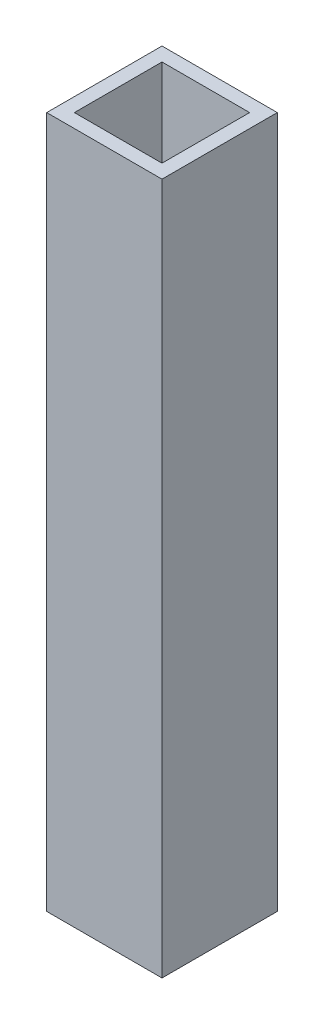
ISO-10303-21;
HEADER;
FILE_DESCRIPTION(('STEP AP214'),'2;1');
FILE_NAME('part.step','',(''),(''),'','','');
FILE_SCHEMA(('AUTOMOTIVE_DESIGN { 1 0 10303 214 1 1 1 1 }'));
ENDSEC;
DATA;
#1=APPLICATION_CONTEXT('core data for automotive mechanical design processes');
#2=APPLICATION_PROTOCOL_DEFINITION('international standard','automotive_design',2000,#1);
#3=PRODUCT_CONTEXT('',#1,'mechanical');
#4=PRODUCT('Part','Part','',(#3));
#5=PRODUCT_RELATED_PRODUCT_CATEGORY('part','',(#4));
#6=PRODUCT_DEFINITION_FORMATION('','',#4);
#7=PRODUCT_DEFINITION_CONTEXT('part definition',#1,'design');
#8=PRODUCT_DEFINITION('design','',#6,#7);
#9=PRODUCT_DEFINITION_SHAPE('','',#8);
#10=(LENGTH_UNIT() NAMED_UNIT(*) SI_UNIT(.MILLI.,.METRE.));
#11=(NAMED_UNIT(*) PLANE_ANGLE_UNIT() SI_UNIT($,.RADIAN.));
#12=(NAMED_UNIT(*) SI_UNIT($,.STERADIAN.) SOLID_ANGLE_UNIT());
#13=UNCERTAINTY_MEASURE_WITH_UNIT(LENGTH_MEASURE(1.E-05),#10,'distance_accuracy_value','');
#14=(GEOMETRIC_REPRESENTATION_CONTEXT(3) GLOBAL_UNCERTAINTY_ASSIGNED_CONTEXT((#13)) GLOBAL_UNIT_ASSIGNED_CONTEXT((#10,
#11,#12)) REPRESENTATION_CONTEXT('',''));
#15=CARTESIAN_POINT('',(0.,0.,0.));
#16=DIRECTION('',(0.,0.,1.));
#17=DIRECTION('',(1.,0.,0.));
#18=AXIS2_PLACEMENT_3D('',#15,#16,#17);
#19=CARTESIAN_POINT('',(0.,150.,0.));
#20=DIRECTION('',(0.,1.,0.));
#21=DIRECTION('',(0.,0.,1.));
#22=AXIS2_PLACEMENT_3D('',#19,#20,#21);
#23=PLANE('',#22);
#24=DIRECTION('',(0.,0.,-1.));
#25=VECTOR('',#24,1.);
#26=CARTESIAN_POINT('',(12.5,150.,-12.5));
#27=LINE('',#26,#25);
#28=CARTESIAN_POINT('',(12.5,150.,12.5));
#29=VERTEX_POINT('',#28);
#30=CARTESIAN_POINT('',(12.5,150.,-12.5));
#31=VERTEX_POINT('',#30);
#32=EDGE_CURVE('E134',#29,#31,#27,.T.);
#33=ORIENTED_EDGE('',*,*,#32,.T.);
#34=DIRECTION('',(-1.,0.,0.));
#35=VECTOR('',#34,1.);
#36=CARTESIAN_POINT('',(-12.5,150.,-12.5));
#37=LINE('',#36,#35);
#38=CARTESIAN_POINT('',(-12.5,150.,-12.5));
#39=VERTEX_POINT('',#38);
#40=EDGE_CURVE('E137',#31,#39,#37,.T.);
#41=ORIENTED_EDGE('',*,*,#40,.T.);
#42=DIRECTION('',(0.,0.,1.));
#43=VECTOR('',#42,1.);
#44=CARTESIAN_POINT('',(-12.5,150.,-12.5));
#45=LINE('',#44,#43);
#46=CARTESIAN_POINT('',(-12.5,150.,12.5));
#47=VERTEX_POINT('',#46);
#48=EDGE_CURVE('E140',#39,#47,#45,.T.);
#49=ORIENTED_EDGE('',*,*,#48,.T.);
#50=DIRECTION('',(1.,0.,0.));
#51=VECTOR('',#50,1.);
#52=CARTESIAN_POINT('',(-12.5,150.,12.5));
#53=LINE('',#52,#51);
#54=EDGE_CURVE('E142',#47,#29,#53,.T.);
#55=ORIENTED_EDGE('',*,*,#54,.T.);
#56=EDGE_LOOP('',(#33,#41,#49,#55));
#57=FACE_BOUND('',#56,.T.);
#58=DIRECTION('',(1.,0.,0.));
#59=VECTOR('',#58,1.);
#60=CARTESIAN_POINT('',(-9.5,150.,9.5));
#61=LINE('',#60,#59);
#62=CARTESIAN_POINT('',(-9.5,150.,9.5));
#63=VERTEX_POINT('',#62);
#64=CARTESIAN_POINT('',(9.5,150.,9.5));
#65=VERTEX_POINT('',#64);
#66=EDGE_CURVE('E106',#63,#65,#61,.T.);
#67=ORIENTED_EDGE('',*,*,#66,.F.);
#68=DIRECTION('',(0.,0.,1.));
#69=VECTOR('',#68,1.);
#70=CARTESIAN_POINT('',(-9.5,150.,-9.5));
#71=LINE('',#70,#69);
#72=CARTESIAN_POINT('',(-9.5,150.,-9.5));
#73=VERTEX_POINT('',#72);
#74=EDGE_CURVE('E98',#73,#63,#71,.T.);
#75=ORIENTED_EDGE('',*,*,#74,.F.);
#76=DIRECTION('',(-1.,0.,0.));
#77=VECTOR('',#76,1.);
#78=CARTESIAN_POINT('',(-9.5,150.,-9.5));
#79=LINE('',#78,#77);
#80=CARTESIAN_POINT('',(9.5,150.,-9.5));
#81=VERTEX_POINT('',#80);
#82=EDGE_CURVE('E120',#81,#73,#79,.T.);
#83=ORIENTED_EDGE('',*,*,#82,.F.);
#84=DIRECTION('',(0.,0.,-1.));
#85=VECTOR('',#84,1.);
#86=CARTESIAN_POINT('',(9.5,150.,-9.5));
#87=LINE('',#86,#85);
#88=EDGE_CURVE('E118',#65,#81,#87,.T.);
#89=ORIENTED_EDGE('',*,*,#88,.F.);
#90=EDGE_LOOP('',(#67,#75,#83,#89));
#91=FACE_BOUND('',#90,.T.);
#92=ADVANCED_FACE('F33',(#57,#91),#23,.T.);
#93=CARTESIAN_POINT('',(0.,0.,0.));
#94=DIRECTION('',(0.,1.,0.));
#95=DIRECTION('',(0.,0.,1.));
#96=AXIS2_PLACEMENT_3D('',#93,#94,#95);
#97=PLANE('',#96);
#98=DIRECTION('',(0.,0.,-1.));
#99=VECTOR('',#98,1.);
#100=CARTESIAN_POINT('',(12.5,0.,-12.5));
#101=LINE('',#100,#99);
#102=CARTESIAN_POINT('',(12.5,0.,12.5));
#103=VERTEX_POINT('',#102);
#104=CARTESIAN_POINT('',(12.5,0.,-12.5));
#105=VERTEX_POINT('',#104);
#106=EDGE_CURVE('E114',#103,#105,#101,.T.);
#107=ORIENTED_EDGE('',*,*,#106,.F.);
#108=DIRECTION('',(1.,0.,0.));
#109=VECTOR('',#108,1.);
#110=CARTESIAN_POINT('',(-12.5,0.,12.5));
#111=LINE('',#110,#109);
#112=CARTESIAN_POINT('',(-12.5,0.,12.5));
#113=VERTEX_POINT('',#112);
#114=EDGE_CURVE('E138',#113,#103,#111,.T.);
#115=ORIENTED_EDGE('',*,*,#114,.F.);
#116=DIRECTION('',(0.,0.,1.));
#117=VECTOR('',#116,1.);
#118=CARTESIAN_POINT('',(-12.5,0.,-12.5));
#119=LINE('',#118,#117);
#120=CARTESIAN_POINT('',(-12.5,0.,-12.5));
#121=VERTEX_POINT('',#120);
#122=EDGE_CURVE('E149',#121,#113,#119,.T.);
#123=ORIENTED_EDGE('',*,*,#122,.F.);
#124=DIRECTION('',(-1.,0.,0.));
#125=VECTOR('',#124,1.);
#126=CARTESIAN_POINT('',(-12.5,0.,-12.5));
#127=LINE('',#126,#125);
#128=EDGE_CURVE('E147',#105,#121,#127,.T.);
#129=ORIENTED_EDGE('',*,*,#128,.F.);
#130=EDGE_LOOP('',(#107,#115,#123,#129));
#131=FACE_BOUND('',#130,.T.);
#132=DIRECTION('',(0.,0.,1.));
#133=VECTOR('',#132,1.);
#134=CARTESIAN_POINT('',(-9.5,0.,-9.5));
#135=LINE('',#134,#133);
#136=CARTESIAN_POINT('',(-9.5,0.,-9.5));
#137=VERTEX_POINT('',#136);
#138=CARTESIAN_POINT('',(-9.5,0.,9.5));
#139=VERTEX_POINT('',#138);
#140=EDGE_CURVE('E56',#137,#139,#135,.T.);
#141=ORIENTED_EDGE('',*,*,#140,.T.);
#142=DIRECTION('',(1.,0.,0.));
#143=VECTOR('',#142,1.);
#144=CARTESIAN_POINT('',(-9.5,0.,9.5));
#145=LINE('',#144,#143);
#146=CARTESIAN_POINT('',(9.5,0.,9.5));
#147=VERTEX_POINT('',#146);
#148=EDGE_CURVE('E113',#139,#147,#145,.T.);
#149=ORIENTED_EDGE('',*,*,#148,.T.);
#150=DIRECTION('',(0.,0.,-1.));
#151=VECTOR('',#150,1.);
#152=CARTESIAN_POINT('',(9.5,0.,-9.5));
#153=LINE('',#152,#151);
#154=CARTESIAN_POINT('',(9.5,0.,-9.5));
#155=VERTEX_POINT('',#154);
#156=EDGE_CURVE('E126',#147,#155,#153,.T.);
#157=ORIENTED_EDGE('',*,*,#156,.T.);
#158=DIRECTION('',(-1.,0.,0.));
#159=VECTOR('',#158,1.);
#160=CARTESIAN_POINT('',(-9.5,0.,-9.5));
#161=LINE('',#160,#159);
#162=EDGE_CURVE('E107',#155,#137,#161,.T.);
#163=ORIENTED_EDGE('',*,*,#162,.T.);
#164=EDGE_LOOP('',(#141,#149,#157,#163));
#165=FACE_BOUND('',#164,.T.);
#166=ADVANCED_FACE('F167',(#131,#165),#97,.F.);
#167=CARTESIAN_POINT('',(12.5,150.,-12.5));
#168=DIRECTION('',(-1.,0.,0.));
#169=DIRECTION('',(0.,0.,1.));
#170=AXIS2_PLACEMENT_3D('',#167,#168,#169);
#171=PLANE('',#170);
#172=ORIENTED_EDGE('',*,*,#106,.T.);
#173=DIRECTION('',(0.,-1.,0.));
#174=VECTOR('',#173,1.);
#175=CARTESIAN_POINT('',(12.5,150.,-12.5));
#176=LINE('',#175,#174);
#177=EDGE_CURVE('E11',#31,#105,#176,.T.);
#178=ORIENTED_EDGE('',*,*,#177,.F.);
#179=ORIENTED_EDGE('',*,*,#32,.F.);
#180=DIRECTION('',(0.,-1.,0.));
#181=VECTOR('',#180,1.);
#182=CARTESIAN_POINT('',(12.5,150.,12.5));
#183=LINE('',#182,#181);
#184=EDGE_CURVE('E144',#29,#103,#183,.T.);
#185=ORIENTED_EDGE('',*,*,#184,.T.);
#186=EDGE_LOOP('',(#172,#178,#179,#185));
#187=FACE_BOUND('',#186,.T.);
#188=ADVANCED_FACE('F35',(#187),#171,.F.);
#189=CARTESIAN_POINT('',(-12.5,150.,-12.5));
#190=DIRECTION('',(0.,0.,1.));
#191=DIRECTION('',(1.,0.,0.));
#192=AXIS2_PLACEMENT_3D('',#189,#190,#191);
#193=PLANE('',#192);
#194=ORIENTED_EDGE('',*,*,#128,.T.);
#195=DIRECTION('',(0.,-1.,0.));
#196=VECTOR('',#195,1.);
#197=CARTESIAN_POINT('',(-12.5,150.,-12.5));
#198=LINE('',#197,#196);
#199=EDGE_CURVE('E41',#39,#121,#198,.T.);
#200=ORIENTED_EDGE('',*,*,#199,.F.);
#201=ORIENTED_EDGE('',*,*,#40,.F.);
#202=ORIENTED_EDGE('',*,*,#177,.T.);
#203=EDGE_LOOP('',(#194,#200,#201,#202));
#204=FACE_BOUND('',#203,.T.);
#205=ADVANCED_FACE('F177',(#204),#193,.F.);
#206=CARTESIAN_POINT('',(-12.5,150.,-12.5));
#207=DIRECTION('',(1.,0.,0.));
#208=DIRECTION('',(0.,0.,-1.));
#209=AXIS2_PLACEMENT_3D('',#206,#207,#208);
#210=PLANE('',#209);
#211=ORIENTED_EDGE('',*,*,#122,.T.);
#212=DIRECTION('',(0.,-1.,0.));
#213=VECTOR('',#212,1.);
#214=CARTESIAN_POINT('',(-12.5,150.,12.5));
#215=LINE('',#214,#213);
#216=EDGE_CURVE('E154',#47,#113,#215,.T.);
#217=ORIENTED_EDGE('',*,*,#216,.F.);
#218=ORIENTED_EDGE('',*,*,#48,.F.);
#219=ORIENTED_EDGE('',*,*,#199,.T.);
#220=EDGE_LOOP('',(#211,#217,#218,#219));
#221=FACE_BOUND('',#220,.T.);
#222=ADVANCED_FACE('F161',(#221),#210,.F.);
#223=CARTESIAN_POINT('',(-12.5,150.,12.5));
#224=DIRECTION('',(0.,0.,-1.));
#225=DIRECTION('',(-1.,0.,0.));
#226=AXIS2_PLACEMENT_3D('',#223,#224,#225);
#227=PLANE('',#226);
#228=ORIENTED_EDGE('',*,*,#114,.T.);
#229=ORIENTED_EDGE('',*,*,#184,.F.);
#230=ORIENTED_EDGE('',*,*,#54,.F.);
#231=ORIENTED_EDGE('',*,*,#216,.T.);
#232=EDGE_LOOP('',(#228,#229,#230,#231));
#233=FACE_BOUND('',#232,.T.);
#234=ADVANCED_FACE('F171',(#233),#227,.F.);
#235=CARTESIAN_POINT('',(-9.5,150.,-9.5));
#236=DIRECTION('',(1.,0.,0.));
#237=DIRECTION('',(0.,0.,-1.));
#238=AXIS2_PLACEMENT_3D('',#235,#236,#237);
#239=PLANE('',#238);
#240=ORIENTED_EDGE('',*,*,#140,.F.);
#241=DIRECTION('',(0.,-1.,0.));
#242=VECTOR('',#241,1.);
#243=CARTESIAN_POINT('',(-9.5,150.,-9.5));
#244=LINE('',#243,#242);
#245=EDGE_CURVE('E102',#73,#137,#244,.T.);
#246=ORIENTED_EDGE('',*,*,#245,.F.);
#247=ORIENTED_EDGE('',*,*,#74,.T.);
#248=DIRECTION('',(0.,-1.,0.));
#249=VECTOR('',#248,1.);
#250=CARTESIAN_POINT('',(-9.5,150.,9.5));
#251=LINE('',#250,#249);
#252=EDGE_CURVE('E101',#63,#139,#251,.T.);
#253=ORIENTED_EDGE('',*,*,#252,.T.);
#254=EDGE_LOOP('',(#240,#246,#247,#253));
#255=FACE_BOUND('',#254,.T.);
#256=ADVANCED_FACE('F100',(#255),#239,.T.);
#257=CARTESIAN_POINT('',(-9.5,150.,9.5));
#258=DIRECTION('',(0.,0.,-1.));
#259=DIRECTION('',(-1.,0.,0.));
#260=AXIS2_PLACEMENT_3D('',#257,#258,#259);
#261=PLANE('',#260);
#262=ORIENTED_EDGE('',*,*,#148,.F.);
#263=ORIENTED_EDGE('',*,*,#252,.F.);
#264=ORIENTED_EDGE('',*,*,#66,.T.);
#265=DIRECTION('',(0.,-1.,0.));
#266=VECTOR('',#265,1.);
#267=CARTESIAN_POINT('',(9.5,150.,9.5));
#268=LINE('',#267,#266);
#269=EDGE_CURVE('E115',#65,#147,#268,.T.);
#270=ORIENTED_EDGE('',*,*,#269,.T.);
#271=EDGE_LOOP('',(#262,#263,#264,#270));
#272=FACE_BOUND('',#271,.T.);
#273=ADVANCED_FACE('F110',(#272),#261,.T.);
#274=CARTESIAN_POINT('',(9.5,150.,-9.5));
#275=DIRECTION('',(-1.,0.,0.));
#276=DIRECTION('',(0.,0.,1.));
#277=AXIS2_PLACEMENT_3D('',#274,#275,#276);
#278=PLANE('',#277);
#279=ORIENTED_EDGE('',*,*,#156,.F.);
#280=ORIENTED_EDGE('',*,*,#269,.F.);
#281=ORIENTED_EDGE('',*,*,#88,.T.);
#282=DIRECTION('',(0.,-1.,0.));
#283=VECTOR('',#282,1.);
#284=CARTESIAN_POINT('',(9.5,150.,-9.5));
#285=LINE('',#284,#283);
#286=EDGE_CURVE('E48',#81,#155,#285,.T.);
#287=ORIENTED_EDGE('',*,*,#286,.T.);
#288=EDGE_LOOP('',(#279,#280,#281,#287));
#289=FACE_BOUND('',#288,.T.);
#290=ADVANCED_FACE('F200',(#289),#278,.T.);
#291=CARTESIAN_POINT('',(-9.5,150.,-9.5));
#292=DIRECTION('',(0.,0.,1.));
#293=DIRECTION('',(1.,0.,0.));
#294=AXIS2_PLACEMENT_3D('',#291,#292,#293);
#295=PLANE('',#294);
#296=ORIENTED_EDGE('',*,*,#162,.F.);
#297=ORIENTED_EDGE('',*,*,#286,.F.);
#298=ORIENTED_EDGE('',*,*,#82,.T.);
#299=ORIENTED_EDGE('',*,*,#245,.T.);
#300=EDGE_LOOP('',(#296,#297,#298,#299));
#301=FACE_BOUND('',#300,.T.);
#302=ADVANCED_FACE('F204',(#301),#295,.T.);
#303=CLOSED_SHELL('',(#92,#166,#188,#205,#222,#234,#256,#273,#290,#302));
#304=MANIFOLD_SOLID_BREP('B2',#303);
#305=ADVANCED_BREP_SHAPE_REPRESENTATION('',(#18,#304),#14);
#306=SHAPE_DEFINITION_REPRESENTATION(#9,#305);
ENDSEC;
END-ISO-10303-21;
